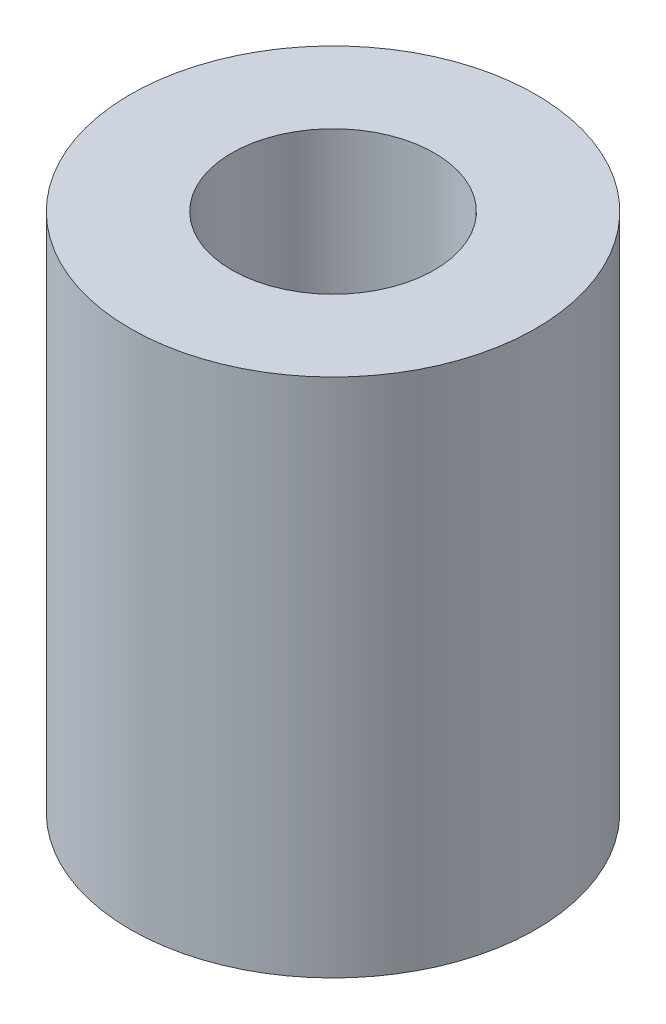
ISO-10303-21;
HEADER;
FILE_DESCRIPTION(('STEP AP214'),'2;1');
FILE_NAME('part.step','',(''),(''),'','','');
FILE_SCHEMA(('AUTOMOTIVE_DESIGN { 1 0 10303 214 1 1 1 1 }'));
ENDSEC;
DATA;
#1=APPLICATION_CONTEXT('core data for automotive mechanical design processes');
#2=APPLICATION_PROTOCOL_DEFINITION('international standard','automotive_design',2000,#1);
#3=PRODUCT_CONTEXT('',#1,'mechanical');
#4=PRODUCT('Part','Part','',(#3));
#5=PRODUCT_RELATED_PRODUCT_CATEGORY('part','',(#4));
#6=PRODUCT_DEFINITION_FORMATION('','',#4);
#7=PRODUCT_DEFINITION_CONTEXT('part definition',#1,'design');
#8=PRODUCT_DEFINITION('design','',#6,#7);
#9=PRODUCT_DEFINITION_SHAPE('','',#8);
#10=(LENGTH_UNIT() NAMED_UNIT(*) SI_UNIT(.MILLI.,.METRE.));
#11=(NAMED_UNIT(*) PLANE_ANGLE_UNIT() SI_UNIT($,.RADIAN.));
#12=(NAMED_UNIT(*) SI_UNIT($,.STERADIAN.) SOLID_ANGLE_UNIT());
#13=UNCERTAINTY_MEASURE_WITH_UNIT(LENGTH_MEASURE(1.E-05),#10,'distance_accuracy_value','');
#14=(GEOMETRIC_REPRESENTATION_CONTEXT(3) GLOBAL_UNCERTAINTY_ASSIGNED_CONTEXT((#13)) GLOBAL_UNIT_ASSIGNED_CONTEXT((#10,
#11,#12)) REPRESENTATION_CONTEXT('',''));
#15=CARTESIAN_POINT('',(0.,0.,0.));
#16=DIRECTION('',(0.,0.,1.));
#17=DIRECTION('',(1.,0.,0.));
#18=AXIS2_PLACEMENT_3D('',#15,#16,#17);
#19=CARTESIAN_POINT('',(0.,7.7,0.));
#20=DIRECTION('',(0.,1.,0.));
#21=DIRECTION('',(0.,0.,1.));
#22=AXIS2_PLACEMENT_3D('',#19,#20,#21);
#23=PLANE('',#22);
#24=CARTESIAN_POINT('',(0.,7.7,0.));
#25=DIRECTION('',(0.,1.,0.));
#26=DIRECTION('',(0.,0.,1.));
#27=AXIS2_PLACEMENT_3D('',#24,#25,#26);
#28=CIRCLE('',#27,3.);
#29=CARTESIAN_POINT('',(0.,7.7,3.));
#30=VERTEX_POINT('',#29);
#31=EDGE_CURVE('E10',#30,#30,#28,.T.);
#32=ORIENTED_EDGE('',*,*,#31,.T.);
#33=EDGE_LOOP('',(#32));
#34=FACE_BOUND('',#33,.T.);
#35=CARTESIAN_POINT('',(0.,7.7,0.));
#36=DIRECTION('',(0.,1.,0.));
#37=DIRECTION('',(0.,0.,1.));
#38=AXIS2_PLACEMENT_3D('',#35,#36,#37);
#39=CIRCLE('',#38,1.5);
#40=CARTESIAN_POINT('',(0.,7.7,1.5));
#41=VERTEX_POINT('',#40);
#42=EDGE_CURVE('E42',#41,#41,#39,.T.);
#43=ORIENTED_EDGE('',*,*,#42,.F.);
#44=EDGE_LOOP('',(#43));
#45=FACE_BOUND('',#44,.T.);
#46=ADVANCED_FACE('F31',(#34,#45),#23,.T.);
#47=CARTESIAN_POINT('',(0.,0.,0.));
#48=DIRECTION('',(0.,1.,0.));
#49=DIRECTION('',(0.,0.,1.));
#50=AXIS2_PLACEMENT_3D('',#47,#48,#49);
#51=PLANE('',#50);
#52=CARTESIAN_POINT('',(0.,0.,0.));
#53=DIRECTION('',(0.,1.,0.));
#54=DIRECTION('',(0.,0.,1.));
#55=AXIS2_PLACEMENT_3D('',#52,#53,#54);
#56=CIRCLE('',#55,3.);
#57=CARTESIAN_POINT('',(0.,0.,3.));
#58=VERTEX_POINT('',#57);
#59=EDGE_CURVE('E35',#58,#58,#56,.T.);
#60=ORIENTED_EDGE('',*,*,#59,.F.);
#61=EDGE_LOOP('',(#60));
#62=FACE_BOUND('',#61,.T.);
#63=CARTESIAN_POINT('',(0.,0.,0.));
#64=DIRECTION('',(0.,1.,0.));
#65=DIRECTION('',(0.,0.,1.));
#66=AXIS2_PLACEMENT_3D('',#63,#64,#65);
#67=CIRCLE('',#66,1.5);
#68=CARTESIAN_POINT('',(0.,0.,1.5));
#69=VERTEX_POINT('',#68);
#70=EDGE_CURVE('E44',#69,#69,#67,.T.);
#71=ORIENTED_EDGE('',*,*,#70,.T.);
#72=EDGE_LOOP('',(#71));
#73=FACE_BOUND('',#72,.T.);
#74=ADVANCED_FACE('F54',(#62,#73),#51,.F.);
#75=CARTESIAN_POINT('',(0.,7.7,0.));
#76=DIRECTION('',(0.,-1.,0.));
#77=DIRECTION('',(0.,0.,-1.));
#78=AXIS2_PLACEMENT_3D('',#75,#76,#77);
#79=CYLINDRICAL_SURFACE('',#78,3.);
#80=ORIENTED_EDGE('',*,*,#31,.F.);
#81=EDGE_LOOP('',(#80));
#82=FACE_BOUND('',#81,.T.);
#83=ORIENTED_EDGE('',*,*,#59,.T.);
#84=EDGE_LOOP('',(#83));
#85=FACE_BOUND('',#84,.T.);
#86=ADVANCED_FACE('F33',(#82,#85),#79,.T.);
#87=CARTESIAN_POINT('',(0.,7.7,0.));
#88=DIRECTION('',(0.,-1.,0.));
#89=DIRECTION('',(0.,0.,-1.));
#90=AXIS2_PLACEMENT_3D('',#87,#88,#89);
#91=CYLINDRICAL_SURFACE('',#90,1.5);
#92=ORIENTED_EDGE('',*,*,#42,.T.);
#93=EDGE_LOOP('',(#92));
#94=FACE_BOUND('',#93,.T.);
#95=ORIENTED_EDGE('',*,*,#70,.F.);
#96=EDGE_LOOP('',(#95));
#97=FACE_BOUND('',#96,.T.);
#98=ADVANCED_FACE('F50',(#94,#97),#91,.F.);
#99=CLOSED_SHELL('',(#46,#74,#86,#98));
#100=MANIFOLD_SOLID_BREP('B2',#99);
#101=ADVANCED_BREP_SHAPE_REPRESENTATION('',(#18,#100),#14);
#102=SHAPE_DEFINITION_REPRESENTATION(#9,#101);
ENDSEC;
END-ISO-10303-21;
